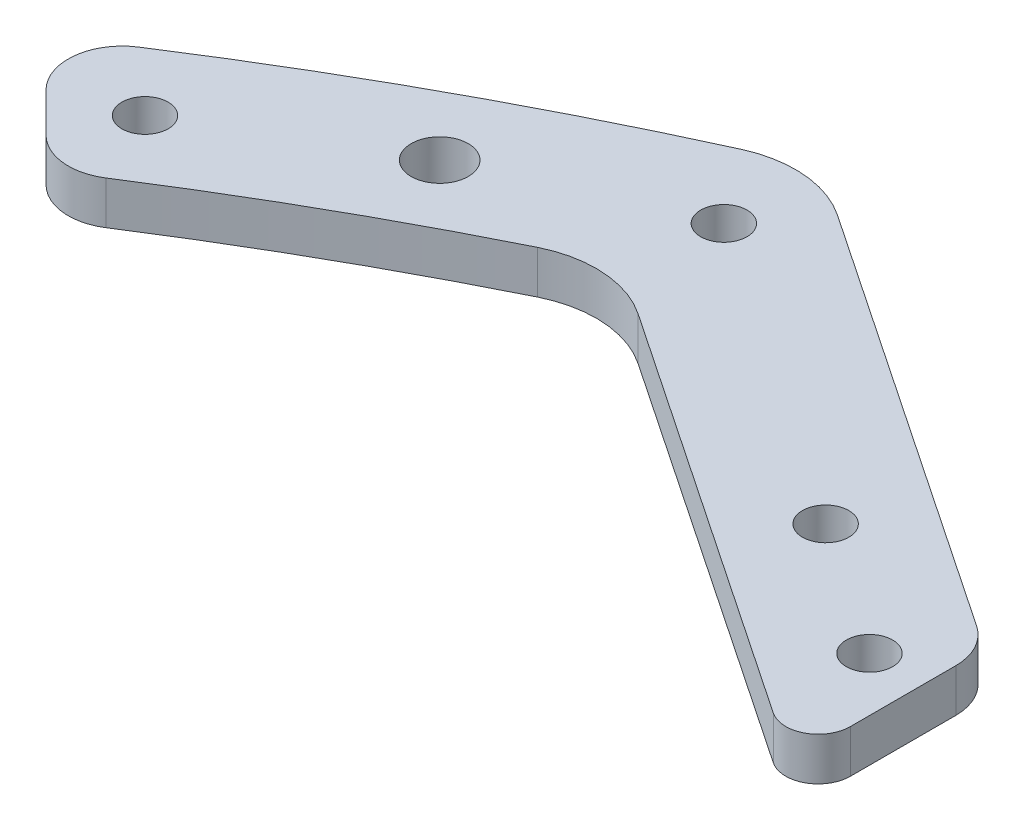
ISO-10303-21;
HEADER;
FILE_DESCRIPTION(('STEP AP214'),'2;1');
FILE_NAME('part.step','',(''),(''),'','','');
FILE_SCHEMA(('AUTOMOTIVE_DESIGN { 1 0 10303 214 1 1 1 1 }'));
ENDSEC;
DATA;
#1=APPLICATION_CONTEXT('core data for automotive mechanical design processes');
#2=APPLICATION_PROTOCOL_DEFINITION('international standard','automotive_design',2000,#1);
#3=PRODUCT_CONTEXT('',#1,'mechanical');
#4=PRODUCT('Part','Part','',(#3));
#5=PRODUCT_RELATED_PRODUCT_CATEGORY('part','',(#4));
#6=PRODUCT_DEFINITION_FORMATION('','',#4);
#7=PRODUCT_DEFINITION_CONTEXT('part definition',#1,'design');
#8=PRODUCT_DEFINITION('design','',#6,#7);
#9=PRODUCT_DEFINITION_SHAPE('','',#8);
#10=(LENGTH_UNIT() NAMED_UNIT(*) SI_UNIT(.MILLI.,.METRE.));
#11=(NAMED_UNIT(*) PLANE_ANGLE_UNIT() SI_UNIT($,.RADIAN.));
#12=(NAMED_UNIT(*) SI_UNIT($,.STERADIAN.) SOLID_ANGLE_UNIT());
#13=UNCERTAINTY_MEASURE_WITH_UNIT(LENGTH_MEASURE(1.E-05),#10,'distance_accuracy_value','');
#14=(GEOMETRIC_REPRESENTATION_CONTEXT(3) GLOBAL_UNCERTAINTY_ASSIGNED_CONTEXT((#13)) GLOBAL_UNIT_ASSIGNED_CONTEXT((#10,
#11,#12)) REPRESENTATION_CONTEXT('',''));
#15=CARTESIAN_POINT('',(0.,0.,0.));
#16=DIRECTION('',(0.,0.,1.));
#17=DIRECTION('',(1.,0.,0.));
#18=AXIS2_PLACEMENT_3D('',#15,#16,#17);
#19=CARTESIAN_POINT('',(0.,20.,0.));
#20=DIRECTION('',(0.,1.,0.));
#21=DIRECTION('',(0.,0.,1.));
#22=AXIS2_PLACEMENT_3D('',#19,#20,#21);
#23=PLANE('',#22);
#24=CARTESIAN_POINT('',(-146.077022116924,20.,-230.028561881911));
#25=DIRECTION('',(0.,1.,0.));
#26=DIRECTION('',(0.,0.,1.));
#27=AXIS2_PLACEMENT_3D('',#24,#25,#26);
#28=CIRCLE('',#27,2.14999999999998);
#29=CARTESIAN_POINT('',(-146.077022116924,20.,-227.878561881911));
#30=VERTEX_POINT('',#29);
#31=EDGE_CURVE('E207',#30,#30,#28,.T.);
#32=ORIENTED_EDGE('',*,*,#31,.F.);
#33=EDGE_LOOP('',(#32));
#34=FACE_BOUND('',#33,.T.);
#35=CARTESIAN_POINT('',(-128.811575357983,20.,-240.123330240531));
#36=DIRECTION('',(0.,1.,0.));
#37=DIRECTION('',(0.,0.,1.));
#38=AXIS2_PLACEMENT_3D('',#35,#36,#37);
#39=CIRCLE('',#38,2.65000000000002);
#40=CARTESIAN_POINT('',(-128.811575357983,20.,-237.473330240531));
#41=VERTEX_POINT('',#40);
#42=EDGE_CURVE('E211',#41,#41,#39,.T.);
#43=ORIENTED_EDGE('',*,*,#42,.F.);
#44=EDGE_LOOP('',(#43));
#45=FACE_BOUND('',#44,.T.);
#46=CARTESIAN_POINT('',(-81.6398875240773,20.,-228.786950774274));
#47=DIRECTION('',(0.,1.,0.));
#48=DIRECTION('',(0.,0.,1.));
#49=AXIS2_PLACEMENT_3D('',#46,#47,#48);
#50=CIRCLE('',#49,2.15);
#51=CARTESIAN_POINT('',(-81.6398875240773,20.,-226.636950774274));
#52=VERTEX_POINT('',#51);
#53=EDGE_CURVE('E222',#52,#52,#50,.T.);
#54=ORIENTED_EDGE('',*,*,#53,.F.);
#55=EDGE_LOOP('',(#54));
#56=FACE_BOUND('',#55,.T.);
#57=CARTESIAN_POINT('',(-69.1949044966264,20.,-220.413039057134));
#58=DIRECTION('',(0.,1.,0.));
#59=DIRECTION('',(0.,0.,1.));
#60=AXIS2_PLACEMENT_3D('',#57,#58,#59);
#61=CIRCLE('',#60,2.15);
#62=CARTESIAN_POINT('',(-69.1949044966264,20.,-218.263039057134));
#63=VERTEX_POINT('',#62);
#64=EDGE_CURVE('E218',#63,#63,#61,.T.);
#65=ORIENTED_EDGE('',*,*,#64,.F.);
#66=EDGE_LOOP('',(#65));
#67=FACE_BOUND('',#66,.T.);
#68=CARTESIAN_POINT('',(-110.52513989388,20.,-248.223100485246));
#69=DIRECTION('',(0.,1.,0.));
#70=DIRECTION('',(0.,0.,1.));
#71=AXIS2_PLACEMENT_3D('',#68,#69,#70);
#72=CIRCLE('',#71,2.15);
#73=CARTESIAN_POINT('',(-110.52513989388,20.,-246.073100485246));
#74=VERTEX_POINT('',#73);
#75=EDGE_CURVE('E221',#74,#74,#72,.T.);
#76=ORIENTED_EDGE('',*,*,#75,.F.);
#77=EDGE_LOOP('',(#76));
#78=FACE_BOUND('',#77,.T.);
#79=CARTESIAN_POINT('',(0.,20.,0.));
#80=DIRECTION('',(0.,1.,0.));
#81=DIRECTION('',(0.,0.,1.));
#82=AXIS2_PLACEMENT_3D('',#79,#80,#81);
#83=CIRCLE('',#82,280.);
#84=CARTESIAN_POINT('',(-115.662879671342,20.,-254.994310262273));
#85=VERTEX_POINT('',#84);
#86=CARTESIAN_POINT('',(-151.898531332941,20.,-235.216572925667));
#87=VERTEX_POINT('',#86);
#88=EDGE_CURVE('E234',#85,#87,#83,.T.);
#89=ORIENTED_EDGE('',*,*,#88,.T.);
#90=CARTESIAN_POINT('',(-149.186057559138,20.,-231.016276980566));
#91=DIRECTION('',(0.,1.,0.));
#92=DIRECTION('',(0.,0.,1.));
#93=AXIS2_PLACEMENT_3D('',#90,#91,#92);
#94=CIRCLE('',#93,5.);
#95=CARTESIAN_POINT('',(-152.721591465071,20.,-227.480743074633));
#96=VERTEX_POINT('',#95);
#97=EDGE_CURVE('E185',#87,#96,#94,.T.);
#98=ORIENTED_EDGE('',*,*,#97,.T.);
#99=DIRECTION('',(0.707106781186547,0.,0.707106781186548));
#100=VECTOR('',#99,1.);
#101=CARTESIAN_POINT('',(-157.049761777423,20.,-231.808913386985));
#102=LINE('',#101,#100);
#103=CARTESIAN_POINT('',(-149.103543531421,20.,-223.862695140983));
#104=VERTEX_POINT('',#103);
#105=EDGE_CURVE('E208',#96,#104,#102,.T.);
#106=ORIENTED_EDGE('',*,*,#105,.T.);
#107=CARTESIAN_POINT('',(-145.568009625488,20.,-227.398229046916));
#108=DIRECTION('',(0.,1.,0.));
#109=DIRECTION('',(0.,0.,1.));
#110=AXIS2_PLACEMENT_3D('',#107,#108,#109);
#111=CIRCLE('',#110,5.);
#112=CARTESIAN_POINT('',(-142.872305743535,20.,-223.187150731232));
#113=VERTEX_POINT('',#112);
#114=EDGE_CURVE('E183',#104,#113,#111,.T.);
#115=ORIENTED_EDGE('',*,*,#114,.T.);
#116=CARTESIAN_POINT('',(0.,20.,0.));
#117=DIRECTION('',(0.,1.,0.));
#118=DIRECTION('',(0.,0.,1.));
#119=AXIS2_PLACEMENT_3D('',#116,#117,#118);
#120=CIRCLE('',#119,265.);
#121=CARTESIAN_POINT('',(-117.253390888974,20.,-237.648148162441));
#122=VERTEX_POINT('',#121);
#123=EDGE_CURVE('E231',#122,#113,#120,.T.);
#124=ORIENTED_EDGE('',*,*,#123,.F.);
#125=CARTESIAN_POINT('',(-112.828734629012,20.,-228.680293514802));
#126=DIRECTION('',(0.,1.,0.));
#127=DIRECTION('',(0.,0.,1.));
#128=AXIS2_PLACEMENT_3D('',#125,#126,#127);
#129=CIRCLE('',#128,10.);
#130=CARTESIAN_POINT('',(-107.246126817586,20.,-236.976948866436));
#131=VERTEX_POINT('',#130);
#132=EDGE_CURVE('E176',#122,#131,#129,.F.);
#133=ORIENTED_EDGE('',*,*,#132,.T.);
#134=DIRECTION('',(-0.829665535163396,0.,-0.55826078114268));
#135=VECTOR('',#134,1.);
#136=CARTESIAN_POINT('',(-111.993839361285,20.,-240.171563564712));
#137=LINE('',#136,#135);
#138=CARTESIAN_POINT('',(-68.8696868400544,20.,-211.15442105092));
#139=VERTEX_POINT('',#138);
#140=EDGE_CURVE('E229',#139,#131,#137,.T.);
#141=ORIENTED_EDGE('',*,*,#140,.F.);
#142=CARTESIAN_POINT('',(-67.1949044966264,20.,-213.64341765641));
#143=DIRECTION('',(0.,1.,0.));
#144=DIRECTION('',(0.,0.,1.));
#145=AXIS2_PLACEMENT_3D('',#142,#143,#144);
#146=CIRCLE('',#145,3.);
#147=CARTESIAN_POINT('',(-64.1949044966264,20.,-213.64341765641));
#148=VERTEX_POINT('',#147);
#149=EDGE_CURVE('E153',#139,#148,#146,.T.);
#150=ORIENTED_EDGE('',*,*,#149,.T.);
#151=DIRECTION('',(0.,0.,-1.));
#152=VECTOR('',#151,1.);
#153=CARTESIAN_POINT('',(-64.1949044966264,20.,-226.088453901695));
#154=LINE('',#153,#152);
#155=CARTESIAN_POINT('',(-64.1949044966264,20.,-223.426301503317));
#156=VERTEX_POINT('',#155);
#157=EDGE_CURVE('E202',#148,#156,#154,.T.);
#158=ORIENTED_EDGE('',*,*,#157,.T.);
#159=CARTESIAN_POINT('',(-69.1949044966264,20.,-223.426301503317));
#160=DIRECTION('',(0.,1.,0.));
#161=DIRECTION('',(0.,0.,1.));
#162=AXIS2_PLACEMENT_3D('',#159,#160,#161);
#163=CIRCLE('',#162,5.);
#164=CARTESIAN_POINT('',(-66.403600590913,20.,-227.574629179134));
#165=VERTEX_POINT('',#164);
#166=EDGE_CURVE('E181',#156,#165,#163,.T.);
#167=ORIENTED_EDGE('',*,*,#166,.T.);
#168=DIRECTION('',(-0.829665535163396,0.,-0.55826078114268));
#169=VECTOR('',#168,1.);
#170=CARTESIAN_POINT('',(-110.52513989388,20.,-257.262887823794));
#171=LINE('',#170,#169);
#172=CARTESIAN_POINT('',(-105.949454728796,20.,-254.184025961683));
#173=VERTEX_POINT('',#172);
#174=EDGE_CURVE('E156',#165,#173,#171,.T.);
#175=ORIENTED_EDGE('',*,*,#174,.T.);
#176=CARTESIAN_POINT('',(-111.532062540223,20.,-245.887370610049));
#177=DIRECTION('',(0.,1.,0.));
#178=DIRECTION('',(0.,0.,1.));
#179=AXIS2_PLACEMENT_3D('',#176,#177,#178);
#180=CIRCLE('',#179,10.);
#181=EDGE_CURVE('E169',#173,#85,#180,.T.);
#182=ORIENTED_EDGE('',*,*,#181,.T.);
#183=EDGE_LOOP('',(#89,#98,#106,#115,#124,#133,#141,#150,#158,#167,#175,#182));
#184=FACE_BOUND('',#183,.T.);
#185=ADVANCED_FACE('F38',(#34,#45,#56,#67,#78,#184),#23,.T.);
#186=CARTESIAN_POINT('',(0.,20.,0.));
#187=DIRECTION('',(0.,-1.,0.));
#188=DIRECTION('',(0.,0.,-1.));
#189=AXIS2_PLACEMENT_3D('',#186,#187,#188);
#190=CYLINDRICAL_SURFACE('',#189,280.);
#191=CARTESIAN_POINT('',(0.,16.,0.));
#192=DIRECTION('',(0.,1.,0.));
#193=DIRECTION('',(-1.,0.,0.));
#194=AXIS2_PLACEMENT_3D('',#191,#192,#193);
#195=CIRCLE('',#194,280.);
#196=CARTESIAN_POINT('',(-115.662879671342,16.,-254.994310262273));
#197=VERTEX_POINT('',#196);
#198=CARTESIAN_POINT('',(-151.898531332941,16.,-235.216572925667));
#199=VERTEX_POINT('',#198);
#200=EDGE_CURVE('E248',#197,#199,#195,.T.);
#201=ORIENTED_EDGE('',*,*,#200,.T.);
#202=DIRECTION('',(0.,-1.,0.));
#203=VECTOR('',#202,1.);
#204=CARTESIAN_POINT('',(-151.898531332941,20.,-235.216572925667));
#205=LINE('',#204,#203);
#206=EDGE_CURVE('E178',#199,#87,#205,.F.);
#207=ORIENTED_EDGE('',*,*,#206,.T.);
#208=ORIENTED_EDGE('',*,*,#88,.F.);
#209=DIRECTION('',(0.,-1.,0.));
#210=VECTOR('',#209,1.);
#211=CARTESIAN_POINT('',(-115.662879671342,20.,-254.994310262273));
#212=LINE('',#211,#210);
#213=EDGE_CURVE('E138',#85,#197,#212,.T.);
#214=ORIENTED_EDGE('',*,*,#213,.T.);
#215=EDGE_LOOP('',(#201,#207,#208,#214));
#216=FACE_BOUND('',#215,.T.);
#217=ADVANCED_FACE('F247',(#216),#190,.T.);
#218=CARTESIAN_POINT('',(-110.52513989388,20.,-257.262887823794));
#219=DIRECTION('',(-0.55826078114268,0.,0.829665535163396));
#220=DIRECTION('',(0.829665535163396,0.,0.55826078114268));
#221=AXIS2_PLACEMENT_3D('',#218,#219,#220);
#222=PLANE('',#221);
#223=ORIENTED_EDGE('',*,*,#174,.F.);
#224=DIRECTION('',(0.,1.,0.));
#225=VECTOR('',#224,1.);
#226=CARTESIAN_POINT('',(-66.403600590913,16.,-227.574629179134));
#227=LINE('',#226,#225);
#228=CARTESIAN_POINT('',(-66.403600590913,16.,-227.574629179134));
#229=VERTEX_POINT('',#228);
#230=EDGE_CURVE('E12',#165,#229,#227,.F.);
#231=ORIENTED_EDGE('',*,*,#230,.T.);
#232=DIRECTION('',(-0.829665535163396,0.,-0.55826078114268));
#233=VECTOR('',#232,1.);
#234=CARTESIAN_POINT('',(-110.52513989388,16.,-257.262887823794));
#235=LINE('',#234,#233);
#236=CARTESIAN_POINT('',(-105.949454728796,16.,-254.184025961683));
#237=VERTEX_POINT('',#236);
#238=EDGE_CURVE('E150',#229,#237,#235,.T.);
#239=ORIENTED_EDGE('',*,*,#238,.T.);
#240=DIRECTION('',(0.,-1.,0.));
#241=VECTOR('',#240,1.);
#242=CARTESIAN_POINT('',(-105.949454728796,20.,-254.184025961683));
#243=LINE('',#242,#241);
#244=EDGE_CURVE('E166',#237,#173,#243,.F.);
#245=ORIENTED_EDGE('',*,*,#244,.T.);
#246=EDGE_LOOP('',(#223,#231,#239,#245));
#247=FACE_BOUND('',#246,.T.);
#248=ADVANCED_FACE('F240',(#247),#222,.F.);
#249=CARTESIAN_POINT('',(-111.993839361285,20.,-240.171563564712));
#250=DIRECTION('',(-0.55826078114268,0.,0.829665535163396));
#251=DIRECTION('',(0.829665535163396,0.,0.55826078114268));
#252=AXIS2_PLACEMENT_3D('',#249,#250,#251);
#253=PLANE('',#252);
#254=ORIENTED_EDGE('',*,*,#140,.T.);
#255=DIRECTION('',(0.,1.,0.));
#256=VECTOR('',#255,1.);
#257=CARTESIAN_POINT('',(-107.246126817586,16.,-236.976948866436));
#258=LINE('',#257,#256);
#259=CARTESIAN_POINT('',(-107.246126817586,16.,-236.976948866436));
#260=VERTEX_POINT('',#259);
#261=EDGE_CURVE('E149',#131,#260,#258,.F.);
#262=ORIENTED_EDGE('',*,*,#261,.T.);
#263=DIRECTION('',(-0.829665535163396,0.,-0.55826078114268));
#264=VECTOR('',#263,1.);
#265=CARTESIAN_POINT('',(-111.993839361285,16.,-240.171563564712));
#266=LINE('',#265,#264);
#267=CARTESIAN_POINT('',(-68.8696868400544,16.,-211.15442105092));
#268=VERTEX_POINT('',#267);
#269=EDGE_CURVE('E132',#268,#260,#266,.T.);
#270=ORIENTED_EDGE('',*,*,#269,.F.);
#271=DIRECTION('',(0.,1.,0.));
#272=VECTOR('',#271,1.);
#273=CARTESIAN_POINT('',(-68.8696868400544,20.,-211.15442105092));
#274=LINE('',#273,#272);
#275=EDGE_CURVE('E146',#268,#139,#274,.T.);
#276=ORIENTED_EDGE('',*,*,#275,.T.);
#277=EDGE_LOOP('',(#254,#262,#270,#276));
#278=FACE_BOUND('',#277,.T.);
#279=ADVANCED_FACE('F145',(#278),#253,.T.);
#280=CARTESIAN_POINT('',(0.,20.,0.));
#281=DIRECTION('',(0.,-1.,0.));
#282=DIRECTION('',(0.,0.,-1.));
#283=AXIS2_PLACEMENT_3D('',#280,#281,#282);
#284=CYLINDRICAL_SURFACE('',#283,265.);
#285=ORIENTED_EDGE('',*,*,#123,.T.);
#286=DIRECTION('',(0.,-1.,0.));
#287=VECTOR('',#286,1.);
#288=CARTESIAN_POINT('',(-142.872305743535,20.,-223.187150731232));
#289=LINE('',#288,#287);
#290=CARTESIAN_POINT('',(-142.872305743535,16.,-223.187150731232));
#291=VERTEX_POINT('',#290);
#292=EDGE_CURVE('E195',#113,#291,#289,.T.);
#293=ORIENTED_EDGE('',*,*,#292,.T.);
#294=CARTESIAN_POINT('',(0.,16.,0.));
#295=DIRECTION('',(0.,1.,0.));
#296=DIRECTION('',(-1.,0.,0.));
#297=AXIS2_PLACEMENT_3D('',#294,#295,#296);
#298=CIRCLE('',#297,265.);
#299=CARTESIAN_POINT('',(-117.253390888974,16.,-237.648148162441));
#300=VERTEX_POINT('',#299);
#301=EDGE_CURVE('E253',#300,#291,#298,.T.);
#302=ORIENTED_EDGE('',*,*,#301,.F.);
#303=DIRECTION('',(0.,-1.,0.));
#304=VECTOR('',#303,1.);
#305=CARTESIAN_POINT('',(-117.253390888974,20.,-237.648148162441));
#306=LINE('',#305,#304);
#307=EDGE_CURVE('E172',#300,#122,#306,.F.);
#308=ORIENTED_EDGE('',*,*,#307,.T.);
#309=EDGE_LOOP('',(#285,#293,#302,#308));
#310=FACE_BOUND('',#309,.T.);
#311=ADVANCED_FACE('F321',(#310),#284,.F.);
#312=CARTESIAN_POINT('',(-146.077022116924,0.,-230.028561881911));
#313=DIRECTION('',(0.,1.,0.));
#314=DIRECTION('',(0.,0.,1.));
#315=AXIS2_PLACEMENT_3D('',#312,#313,#314);
#316=CYLINDRICAL_SURFACE('',#315,2.14999999999998);
#317=CARTESIAN_POINT('',(-146.077022116924,16.,-230.028561881911));
#318=DIRECTION('',(0.,1.,0.));
#319=DIRECTION('',(-1.,0.,0.));
#320=AXIS2_PLACEMENT_3D('',#317,#318,#319);
#321=CIRCLE('',#320,2.14999999999998);
#322=CARTESIAN_POINT('',(-148.227022116924,16.,-230.028561881911));
#323=VERTEX_POINT('',#322);
#324=EDGE_CURVE('E214',#323,#323,#321,.F.);
#325=ORIENTED_EDGE('',*,*,#324,.T.);
#326=EDGE_LOOP('',(#325));
#327=FACE_BOUND('',#326,.T.);
#328=ORIENTED_EDGE('',*,*,#31,.T.);
#329=EDGE_LOOP('',(#328));
#330=FACE_BOUND('',#329,.T.);
#331=ADVANCED_FACE('F273',(#327,#330),#316,.F.);
#332=CARTESIAN_POINT('',(-128.811575357983,0.,-240.123330240531));
#333=DIRECTION('',(0.,1.,0.));
#334=DIRECTION('',(0.,0.,1.));
#335=AXIS2_PLACEMENT_3D('',#332,#333,#334);
#336=CYLINDRICAL_SURFACE('',#335,2.65000000000002);
#337=CARTESIAN_POINT('',(-128.811575357983,16.,-240.123330240531));
#338=DIRECTION('',(0.,1.,0.));
#339=DIRECTION('',(-1.,0.,0.));
#340=AXIS2_PLACEMENT_3D('',#337,#338,#339);
#341=CIRCLE('',#340,2.65000000000002);
#342=CARTESIAN_POINT('',(-131.461575357983,16.,-240.123330240531));
#343=VERTEX_POINT('',#342);
#344=EDGE_CURVE('E268',#343,#343,#341,.F.);
#345=ORIENTED_EDGE('',*,*,#344,.T.);
#346=EDGE_LOOP('',(#345));
#347=FACE_BOUND('',#346,.T.);
#348=ORIENTED_EDGE('',*,*,#42,.T.);
#349=EDGE_LOOP('',(#348));
#350=FACE_BOUND('',#349,.T.);
#351=ADVANCED_FACE('F343',(#347,#350),#336,.F.);
#352=CARTESIAN_POINT('',(-81.6398875240773,0.,-228.786950774274));
#353=DIRECTION('',(0.,1.,0.));
#354=DIRECTION('',(0.,0.,1.));
#355=AXIS2_PLACEMENT_3D('',#352,#353,#354);
#356=CYLINDRICAL_SURFACE('',#355,2.15);
#357=CARTESIAN_POINT('',(-81.6398875240773,16.,-228.786950774274));
#358=DIRECTION('',(0.,1.,0.));
#359=DIRECTION('',(-1.,0.,0.));
#360=AXIS2_PLACEMENT_3D('',#357,#358,#359);
#361=CIRCLE('',#360,2.15);
#362=CARTESIAN_POINT('',(-83.7898875240773,16.,-228.786950774274));
#363=VERTEX_POINT('',#362);
#364=EDGE_CURVE('E265',#363,#363,#361,.F.);
#365=ORIENTED_EDGE('',*,*,#364,.T.);
#366=EDGE_LOOP('',(#365));
#367=FACE_BOUND('',#366,.T.);
#368=ORIENTED_EDGE('',*,*,#53,.T.);
#369=EDGE_LOOP('',(#368));
#370=FACE_BOUND('',#369,.T.);
#371=ADVANCED_FACE('F339',(#367,#370),#356,.F.);
#372=CARTESIAN_POINT('',(-69.1949044966264,0.,-220.413039057134));
#373=DIRECTION('',(0.,1.,0.));
#374=DIRECTION('',(0.,0.,1.));
#375=AXIS2_PLACEMENT_3D('',#372,#373,#374);
#376=CYLINDRICAL_SURFACE('',#375,2.15);
#377=CARTESIAN_POINT('',(-69.1949044966264,16.,-220.413039057134));
#378=DIRECTION('',(0.,1.,0.));
#379=DIRECTION('',(-1.,0.,0.));
#380=AXIS2_PLACEMENT_3D('',#377,#378,#379);
#381=CIRCLE('',#380,2.15);
#382=CARTESIAN_POINT('',(-71.3449044966264,16.,-220.413039057134));
#383=VERTEX_POINT('',#382);
#384=EDGE_CURVE('E262',#383,#383,#381,.F.);
#385=ORIENTED_EDGE('',*,*,#384,.T.);
#386=EDGE_LOOP('',(#385));
#387=FACE_BOUND('',#386,.T.);
#388=ORIENTED_EDGE('',*,*,#64,.T.);
#389=EDGE_LOOP('',(#388));
#390=FACE_BOUND('',#389,.T.);
#391=ADVANCED_FACE('F333',(#387,#390),#376,.F.);
#392=CARTESIAN_POINT('',(-110.52513989388,0.,-248.223100485246));
#393=DIRECTION('',(0.,1.,0.));
#394=DIRECTION('',(0.,0.,1.));
#395=AXIS2_PLACEMENT_3D('',#392,#393,#394);
#396=CYLINDRICAL_SURFACE('',#395,2.15);
#397=CARTESIAN_POINT('',(-110.52513989388,16.,-248.223100485246));
#398=DIRECTION('',(0.,1.,0.));
#399=DIRECTION('',(-1.,0.,0.));
#400=AXIS2_PLACEMENT_3D('',#397,#398,#399);
#401=CIRCLE('',#400,2.15);
#402=CARTESIAN_POINT('',(-112.67513989388,16.,-248.223100485246));
#403=VERTEX_POINT('',#402);
#404=EDGE_CURVE('E259',#403,#403,#401,.F.);
#405=ORIENTED_EDGE('',*,*,#404,.T.);
#406=EDGE_LOOP('',(#405));
#407=FACE_BOUND('',#406,.T.);
#408=ORIENTED_EDGE('',*,*,#75,.T.);
#409=EDGE_LOOP('',(#408));
#410=FACE_BOUND('',#409,.T.);
#411=ADVANCED_FACE('F328',(#407,#410),#396,.F.);
#412=CARTESIAN_POINT('',(-157.049761777423,0.,-231.808913386985));
#413=DIRECTION('',(-0.707106781186548,0.,0.707106781186547));
#414=DIRECTION('',(0.707106781186547,0.,0.707106781186548));
#415=AXIS2_PLACEMENT_3D('',#412,#413,#414);
#416=PLANE('',#415);
#417=ORIENTED_EDGE('',*,*,#105,.F.);
#418=DIRECTION('',(0.,1.,0.));
#419=VECTOR('',#418,1.);
#420=CARTESIAN_POINT('',(-152.721591465071,16.,-227.480743074633));
#421=LINE('',#420,#419);
#422=CARTESIAN_POINT('',(-152.721591465071,16.,-227.480743074633));
#423=VERTEX_POINT('',#422);
#424=EDGE_CURVE('E189',#96,#423,#421,.F.);
#425=ORIENTED_EDGE('',*,*,#424,.T.);
#426=DIRECTION('',(-0.707106781186547,0.,-0.707106781186548));
#427=VECTOR('',#426,1.);
#428=CARTESIAN_POINT('',(-157.049761777423,16.,-231.808913386985));
#429=LINE('',#428,#427);
#430=CARTESIAN_POINT('',(-149.103543531421,16.,-223.862695140983));
#431=VERTEX_POINT('',#430);
#432=EDGE_CURVE('E251',#431,#423,#429,.T.);
#433=ORIENTED_EDGE('',*,*,#432,.F.);
#434=DIRECTION('',(0.,-1.,0.));
#435=VECTOR('',#434,1.);
#436=CARTESIAN_POINT('',(-149.103543531421,0.,-223.862695140983));
#437=LINE('',#436,#435);
#438=EDGE_CURVE('E187',#431,#104,#437,.F.);
#439=ORIENTED_EDGE('',*,*,#438,.T.);
#440=EDGE_LOOP('',(#417,#425,#433,#439));
#441=FACE_BOUND('',#440,.T.);
#442=ADVANCED_FACE('F284',(#441),#416,.T.);
#443=CARTESIAN_POINT('',(-64.1949044966264,0.,-226.088453901695));
#444=DIRECTION('',(1.,0.,0.));
#445=DIRECTION('',(0.,0.,-1.));
#446=AXIS2_PLACEMENT_3D('',#443,#444,#445);
#447=PLANE('',#446);
#448=DIRECTION('',(0.,0.,1.));
#449=VECTOR('',#448,1.);
#450=CARTESIAN_POINT('',(-64.1949044966264,16.,-226.088453901695));
#451=LINE('',#450,#449);
#452=CARTESIAN_POINT('',(-64.1949044966264,16.,-223.426301503317));
#453=VERTEX_POINT('',#452);
#454=CARTESIAN_POINT('',(-64.1949044966264,16.,-213.64341765641));
#455=VERTEX_POINT('',#454);
#456=EDGE_CURVE('E133',#453,#455,#451,.T.);
#457=ORIENTED_EDGE('',*,*,#456,.F.);
#458=DIRECTION('',(0.,1.,0.));
#459=VECTOR('',#458,1.);
#460=CARTESIAN_POINT('',(-64.1949044966264,20.,-223.426301503317));
#461=LINE('',#460,#459);
#462=EDGE_CURVE('E46',#453,#156,#461,.T.);
#463=ORIENTED_EDGE('',*,*,#462,.T.);
#464=ORIENTED_EDGE('',*,*,#157,.F.);
#465=DIRECTION('',(0.,1.,0.));
#466=VECTOR('',#465,1.);
#467=CARTESIAN_POINT('',(-64.1949044966264,0.,-213.64341765641));
#468=LINE('',#467,#466);
#469=EDGE_CURVE('E139',#148,#455,#468,.F.);
#470=ORIENTED_EDGE('',*,*,#469,.T.);
#471=EDGE_LOOP('',(#457,#463,#464,#470));
#472=FACE_BOUND('',#471,.T.);
#473=ADVANCED_FACE('F201',(#472),#447,.T.);
#474=CARTESIAN_POINT('',(-54.4817658344089,16.,-496.699878048763));
#475=DIRECTION('',(0.,1.,0.));
#476=DIRECTION('',(-1.,0.,0.));
#477=AXIS2_PLACEMENT_3D('',#474,#475,#476);
#478=PLANE('',#477);
#479=ORIENTED_EDGE('',*,*,#344,.F.);
#480=EDGE_LOOP('',(#479));
#481=FACE_BOUND('',#480,.T.);
#482=ORIENTED_EDGE('',*,*,#384,.F.);
#483=EDGE_LOOP('',(#482));
#484=FACE_BOUND('',#483,.T.);
#485=ORIENTED_EDGE('',*,*,#432,.T.);
#486=CARTESIAN_POINT('',(-149.186057559138,16.,-231.016276980566));
#487=DIRECTION('',(0.,1.,0.));
#488=DIRECTION('',(-1.,0.,0.));
#489=AXIS2_PLACEMENT_3D('',#486,#487,#488);
#490=CIRCLE('',#489,5.);
#491=EDGE_CURVE('E193',#423,#199,#490,.F.);
#492=ORIENTED_EDGE('',*,*,#491,.T.);
#493=ORIENTED_EDGE('',*,*,#200,.F.);
#494=CARTESIAN_POINT('',(-111.532062540223,16.,-245.887370610049));
#495=DIRECTION('',(0.,1.,0.));
#496=DIRECTION('',(-1.,0.,0.));
#497=AXIS2_PLACEMENT_3D('',#494,#495,#496);
#498=CIRCLE('',#497,10.);
#499=EDGE_CURVE('E163',#197,#237,#498,.F.);
#500=ORIENTED_EDGE('',*,*,#499,.T.);
#501=ORIENTED_EDGE('',*,*,#238,.F.);
#502=CARTESIAN_POINT('',(-69.1949044966264,16.,-223.426301503317));
#503=DIRECTION('',(0.,1.,0.));
#504=DIRECTION('',(-1.,0.,0.));
#505=AXIS2_PLACEMENT_3D('',#502,#503,#504);
#506=CIRCLE('',#505,5.);
#507=EDGE_CURVE('E61',#229,#453,#506,.F.);
#508=ORIENTED_EDGE('',*,*,#507,.T.);
#509=ORIENTED_EDGE('',*,*,#456,.T.);
#510=CARTESIAN_POINT('',(-67.1949044966264,16.,-213.64341765641));
#511=DIRECTION('',(0.,1.,0.));
#512=DIRECTION('',(-1.,0.,0.));
#513=AXIS2_PLACEMENT_3D('',#510,#511,#512);
#514=CIRCLE('',#513,3.);
#515=EDGE_CURVE('E127',#455,#268,#514,.F.);
#516=ORIENTED_EDGE('',*,*,#515,.T.);
#517=ORIENTED_EDGE('',*,*,#269,.T.);
#518=CARTESIAN_POINT('',(-112.828734629012,16.,-228.680293514802));
#519=DIRECTION('',(0.,1.,0.));
#520=DIRECTION('',(-1.,0.,0.));
#521=AXIS2_PLACEMENT_3D('',#518,#519,#520);
#522=CIRCLE('',#521,10.);
#523=EDGE_CURVE('E174',#260,#300,#522,.T.);
#524=ORIENTED_EDGE('',*,*,#523,.T.);
#525=ORIENTED_EDGE('',*,*,#301,.T.);
#526=CARTESIAN_POINT('',(-145.568009625488,16.,-227.398229046916));
#527=DIRECTION('',(0.,1.,0.));
#528=DIRECTION('',(-1.,0.,0.));
#529=AXIS2_PLACEMENT_3D('',#526,#527,#528);
#530=CIRCLE('',#529,5.);
#531=EDGE_CURVE('E53',#291,#431,#530,.F.);
#532=ORIENTED_EDGE('',*,*,#531,.T.);
#533=EDGE_LOOP('',(#485,#492,#493,#500,#501,#508,#509,#516,#517,#524,#525,#532));
#534=FACE_BOUND('',#533,.T.);
#535=ORIENTED_EDGE('',*,*,#404,.F.);
#536=EDGE_LOOP('',(#535));
#537=FACE_BOUND('',#536,.T.);
#538=ORIENTED_EDGE('',*,*,#364,.F.);
#539=EDGE_LOOP('',(#538));
#540=FACE_BOUND('',#539,.T.);
#541=ORIENTED_EDGE('',*,*,#324,.F.);
#542=EDGE_LOOP('',(#541));
#543=FACE_BOUND('',#542,.T.);
#544=ADVANCED_FACE('F130',(#481,#484,#534,#537,#540,#543),#478,.F.);
#545=CARTESIAN_POINT('',(-67.1949044966264,20.,-213.64341765641));
#546=DIRECTION('',(0.,1.,0.));
#547=DIRECTION('',(0.,0.,1.));
#548=AXIS2_PLACEMENT_3D('',#545,#546,#547);
#549=CYLINDRICAL_SURFACE('',#548,3.);
#550=ORIENTED_EDGE('',*,*,#515,.F.);
#551=ORIENTED_EDGE('',*,*,#469,.F.);
#552=ORIENTED_EDGE('',*,*,#149,.F.);
#553=ORIENTED_EDGE('',*,*,#275,.F.);
#554=EDGE_LOOP('',(#550,#551,#552,#553));
#555=FACE_BOUND('',#554,.T.);
#556=ADVANCED_FACE('F152',(#555),#549,.T.);
#557=CARTESIAN_POINT('',(-111.532062540223,20.,-245.887370610049));
#558=DIRECTION('',(0.,-1.,0.));
#559=DIRECTION('',(0.,0.,-1.));
#560=AXIS2_PLACEMENT_3D('',#557,#558,#559);
#561=CYLINDRICAL_SURFACE('',#560,10.);
#562=ORIENTED_EDGE('',*,*,#181,.F.);
#563=ORIENTED_EDGE('',*,*,#244,.F.);
#564=ORIENTED_EDGE('',*,*,#499,.F.);
#565=ORIENTED_EDGE('',*,*,#213,.F.);
#566=EDGE_LOOP('',(#562,#563,#564,#565));
#567=FACE_BOUND('',#566,.T.);
#568=ADVANCED_FACE('F243',(#567),#561,.T.);
#569=CARTESIAN_POINT('',(-112.828734629012,20.,-228.680293514802));
#570=DIRECTION('',(0.,-1.,0.));
#571=DIRECTION('',(0.,0.,-1.));
#572=AXIS2_PLACEMENT_3D('',#569,#570,#571);
#573=CYLINDRICAL_SURFACE('',#572,10.);
#574=ORIENTED_EDGE('',*,*,#132,.F.);
#575=ORIENTED_EDGE('',*,*,#307,.F.);
#576=ORIENTED_EDGE('',*,*,#523,.F.);
#577=ORIENTED_EDGE('',*,*,#261,.F.);
#578=EDGE_LOOP('',(#574,#575,#576,#577));
#579=FACE_BOUND('',#578,.T.);
#580=ADVANCED_FACE('F304',(#579),#573,.F.);
#581=CARTESIAN_POINT('',(-149.186057559138,20.,-231.016276980566));
#582=DIRECTION('',(0.,-1.,0.));
#583=DIRECTION('',(0.,0.,-1.));
#584=AXIS2_PLACEMENT_3D('',#581,#582,#583);
#585=CYLINDRICAL_SURFACE('',#584,5.);
#586=ORIENTED_EDGE('',*,*,#491,.F.);
#587=ORIENTED_EDGE('',*,*,#424,.F.);
#588=ORIENTED_EDGE('',*,*,#97,.F.);
#589=ORIENTED_EDGE('',*,*,#206,.F.);
#590=EDGE_LOOP('',(#586,#587,#588,#589));
#591=FACE_BOUND('',#590,.T.);
#592=ADVANCED_FACE('F307',(#591),#585,.T.);
#593=CARTESIAN_POINT('',(-145.568009625488,20.,-227.398229046916));
#594=DIRECTION('',(0.,-1.,0.));
#595=DIRECTION('',(0.,0.,-1.));
#596=AXIS2_PLACEMENT_3D('',#593,#594,#595);
#597=CYLINDRICAL_SURFACE('',#596,5.);
#598=ORIENTED_EDGE('',*,*,#114,.F.);
#599=ORIENTED_EDGE('',*,*,#438,.F.);
#600=ORIENTED_EDGE('',*,*,#531,.F.);
#601=ORIENTED_EDGE('',*,*,#292,.F.);
#602=EDGE_LOOP('',(#598,#599,#600,#601));
#603=FACE_BOUND('',#602,.T.);
#604=ADVANCED_FACE('F310',(#603),#597,.T.);
#605=CARTESIAN_POINT('',(-69.1949044966264,0.,-223.426301503317));
#606=DIRECTION('',(0.,-1.,0.));
#607=DIRECTION('',(0.,0.,-1.));
#608=AXIS2_PLACEMENT_3D('',#605,#606,#607);
#609=CYLINDRICAL_SURFACE('',#608,5.);
#610=ORIENTED_EDGE('',*,*,#507,.F.);
#611=ORIENTED_EDGE('',*,*,#230,.F.);
#612=ORIENTED_EDGE('',*,*,#166,.F.);
#613=ORIENTED_EDGE('',*,*,#462,.F.);
#614=EDGE_LOOP('',(#610,#611,#612,#613));
#615=FACE_BOUND('',#614,.T.);
#616=ADVANCED_FACE('F40',(#615),#609,.T.);
#617=CLOSED_SHELL('',(#185,#217,#248,#279,#311,#331,#351,#371,#391,#411,#442,#473,#544,#556,
#568,#580,#592,#604,#616));
#618=MANIFOLD_SOLID_BREP('B2',#617);
#619=ADVANCED_BREP_SHAPE_REPRESENTATION('',(#18,#618),#14);
#620=SHAPE_DEFINITION_REPRESENTATION(#9,#619);
ENDSEC;
END-ISO-10303-21;
